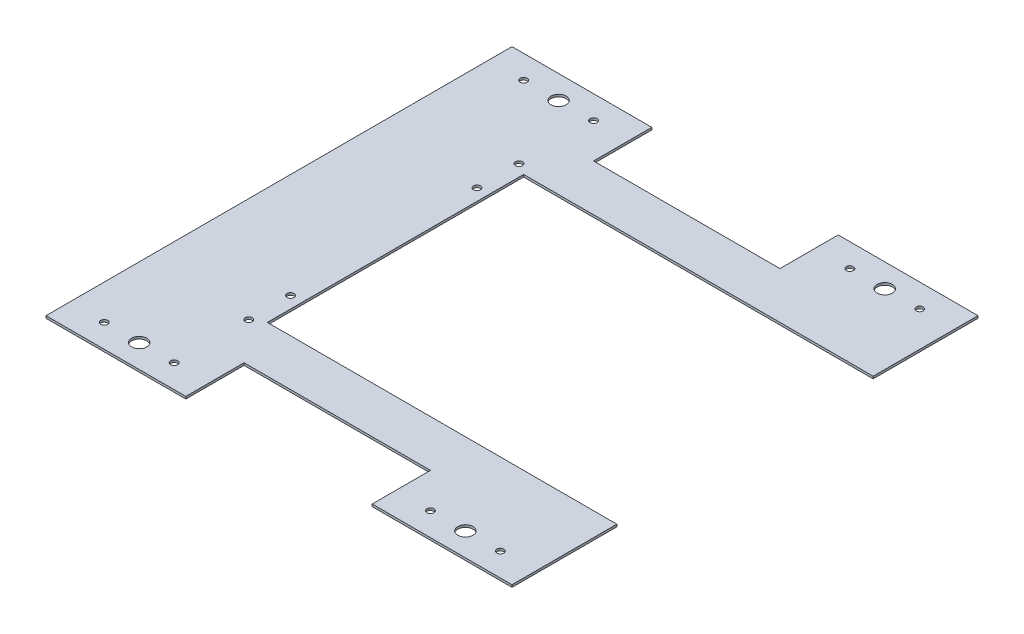
ISO-10303-21;
HEADER;
FILE_DESCRIPTION(('STEP AP214'),'2;1');
FILE_NAME('part.step','',(''),(''),'','','');
FILE_SCHEMA(('AUTOMOTIVE_DESIGN { 1 0 10303 214 1 1 1 1 }'));
ENDSEC;
DATA;
#1=APPLICATION_CONTEXT('core data for automotive mechanical design processes');
#2=APPLICATION_PROTOCOL_DEFINITION('international standard','automotive_design',2000,#1);
#3=PRODUCT_CONTEXT('',#1,'mechanical');
#4=PRODUCT('Part','Part','',(#3));
#5=PRODUCT_RELATED_PRODUCT_CATEGORY('part','',(#4));
#6=PRODUCT_DEFINITION_FORMATION('','',#4);
#7=PRODUCT_DEFINITION_CONTEXT('part definition',#1,'design');
#8=PRODUCT_DEFINITION('design','',#6,#7);
#9=PRODUCT_DEFINITION_SHAPE('','',#8);
#10=(LENGTH_UNIT() NAMED_UNIT(*) SI_UNIT(.MILLI.,.METRE.));
#11=(NAMED_UNIT(*) PLANE_ANGLE_UNIT() SI_UNIT($,.RADIAN.));
#12=(NAMED_UNIT(*) SI_UNIT($,.STERADIAN.) SOLID_ANGLE_UNIT());
#13=UNCERTAINTY_MEASURE_WITH_UNIT(LENGTH_MEASURE(1.E-05),#10,'distance_accuracy_value','');
#14=(GEOMETRIC_REPRESENTATION_CONTEXT(3) GLOBAL_UNCERTAINTY_ASSIGNED_CONTEXT((#13)) GLOBAL_UNIT_ASSIGNED_CONTEXT((#10,
#11,#12)) REPRESENTATION_CONTEXT('',''));
#15=CARTESIAN_POINT('',(0.,0.,0.));
#16=DIRECTION('',(0.,0.,1.));
#17=DIRECTION('',(1.,0.,0.));
#18=AXIS2_PLACEMENT_3D('',#15,#16,#17);
#19=CARTESIAN_POINT('',(100.,1.,-55.));
#20=DIRECTION('',(0.,-1.,0.));
#21=DIRECTION('',(0.,0.,-1.));
#22=AXIS2_PLACEMENT_3D('',#19,#20,#21);
#23=PLANE('',#22);
#24=CARTESIAN_POINT('',(55.,1.,-90.));
#25=DIRECTION('',(0.,1.,0.));
#26=DIRECTION('',(0.,0.,1.));
#27=AXIS2_PLACEMENT_3D('',#24,#25,#26);
#28=CIRCLE('',#27,1.5);
#29=CARTESIAN_POINT('',(55.,1.,-88.5));
#30=VERTEX_POINT('',#29);
#31=EDGE_CURVE('E390',#30,#30,#28,.T.);
#32=ORIENTED_EDGE('',*,*,#31,.F.);
#33=EDGE_LOOP('',(#32));
#34=FACE_BOUND('',#33,.T.);
#35=CARTESIAN_POINT('',(70.,1.,-90.));
#36=DIRECTION('',(0.,1.,0.));
#37=DIRECTION('',(0.,0.,1.));
#38=AXIS2_PLACEMENT_3D('',#35,#36,#37);
#39=CIRCLE('',#38,3.25000000000012);
#40=CARTESIAN_POINT('',(70.,1.,-86.7499999999999));
#41=VERTEX_POINT('',#40);
#42=EDGE_CURVE('E402',#41,#41,#39,.T.);
#43=ORIENTED_EDGE('',*,*,#42,.F.);
#44=EDGE_LOOP('',(#43));
#45=FACE_BOUND('',#44,.T.);
#46=CARTESIAN_POINT('',(-69.9999999999999,1.,90.0000000000001));
#47=DIRECTION('',(0.,1.,0.));
#48=DIRECTION('',(0.,0.,1.));
#49=AXIS2_PLACEMENT_3D('',#46,#47,#48);
#50=CIRCLE('',#49,3.25000000000001);
#51=CARTESIAN_POINT('',(-69.9999999999999,1.,93.2500000000001));
#52=VERTEX_POINT('',#51);
#53=EDGE_CURVE('E414',#52,#52,#50,.T.);
#54=ORIENTED_EDGE('',*,*,#53,.F.);
#55=EDGE_LOOP('',(#54));
#56=FACE_BOUND('',#55,.T.);
#57=CARTESIAN_POINT('',(-54.9999999999999,1.,-39.9999999999999));
#58=DIRECTION('',(0.,1.,0.));
#59=DIRECTION('',(0.,0.,1.));
#60=AXIS2_PLACEMENT_3D('',#57,#58,#59);
#61=CIRCLE('',#60,1.5);
#62=CARTESIAN_POINT('',(-54.9999999999999,1.,-38.4999999999999));
#63=VERTEX_POINT('',#62);
#64=EDGE_CURVE('E426',#63,#63,#61,.T.);
#65=ORIENTED_EDGE('',*,*,#64,.F.);
#66=EDGE_LOOP('',(#65));
#67=FACE_BOUND('',#66,.T.);
#68=CARTESIAN_POINT('',(-54.9999999999999,1.,58.0000000000001));
#69=DIRECTION('',(0.,1.,0.));
#70=DIRECTION('',(0.,0.,1.));
#71=AXIS2_PLACEMENT_3D('',#68,#69,#70);
#72=CIRCLE('',#71,1.5);
#73=CARTESIAN_POINT('',(-54.9999999999999,1.,59.5000000000001));
#74=VERTEX_POINT('',#73);
#75=EDGE_CURVE('E438',#74,#74,#72,.T.);
#76=ORIENTED_EDGE('',*,*,#75,.F.);
#77=EDGE_LOOP('',(#76));
#78=FACE_BOUND('',#77,.T.);
#79=CARTESIAN_POINT('',(55.,1.,90.));
#80=DIRECTION('',(0.,1.,0.));
#81=DIRECTION('',(0.,0.,-1.));
#82=AXIS2_PLACEMENT_3D('',#79,#80,#81);
#83=CIRCLE('',#82,1.5);
#84=CARTESIAN_POINT('',(55.,1.,88.5));
#85=VERTEX_POINT('',#84);
#86=EDGE_CURVE('E450',#85,#85,#83,.T.);
#87=ORIENTED_EDGE('',*,*,#86,.F.);
#88=EDGE_LOOP('',(#87));
#89=FACE_BOUND('',#88,.T.);
#90=CARTESIAN_POINT('',(-55.,1.,90.));
#91=DIRECTION('',(0.,1.,0.));
#92=DIRECTION('',(0.,0.,1.));
#93=AXIS2_PLACEMENT_3D('',#90,#91,#92);
#94=CIRCLE('',#93,1.5);
#95=CARTESIAN_POINT('',(-55.,1.,91.5));
#96=VERTEX_POINT('',#95);
#97=EDGE_CURVE('E462',#96,#96,#94,.T.);
#98=ORIENTED_EDGE('',*,*,#97,.F.);
#99=EDGE_LOOP('',(#98));
#100=FACE_BOUND('',#99,.T.);
#101=CARTESIAN_POINT('',(-85.,1.,-90.));
#102=DIRECTION('',(0.,1.,0.));
#103=DIRECTION('',(0.,0.,-1.));
#104=AXIS2_PLACEMENT_3D('',#101,#102,#103);
#105=CIRCLE('',#104,1.5);
#106=CARTESIAN_POINT('',(-85.,1.,-91.5));
#107=VERTEX_POINT('',#106);
#108=EDGE_CURVE('E180',#107,#107,#105,.T.);
#109=ORIENTED_EDGE('',*,*,#108,.F.);
#110=EDGE_LOOP('',(#109));
#111=FACE_BOUND('',#110,.T.);
#112=DIRECTION('',(0.,0.,-1.));
#113=VECTOR('',#112,1.);
#114=CARTESIAN_POINT('',(100.,1.,-100.));
#115=LINE('',#114,#113);
#116=CARTESIAN_POINT('',(100.,1.,-55.));
#117=VERTEX_POINT('',#116);
#118=CARTESIAN_POINT('',(100.,1.,-100.));
#119=VERTEX_POINT('',#118);
#120=EDGE_CURVE('E207',#117,#119,#115,.T.);
#121=ORIENTED_EDGE('',*,*,#120,.T.);
#122=DIRECTION('',(-1.,0.,0.));
#123=VECTOR('',#122,1.);
#124=CARTESIAN_POINT('',(40.,1.,-100.));
#125=LINE('',#124,#123);
#126=CARTESIAN_POINT('',(40.,1.,-100.));
#127=VERTEX_POINT('',#126);
#128=EDGE_CURVE('E115',#119,#127,#125,.T.);
#129=ORIENTED_EDGE('',*,*,#128,.T.);
#130=DIRECTION('',(0.,0.,1.));
#131=VECTOR('',#130,1.);
#132=CARTESIAN_POINT('',(40.,1.,-100.));
#133=LINE('',#132,#131);
#134=CARTESIAN_POINT('',(40.,1.,-75.));
#135=VERTEX_POINT('',#134);
#136=EDGE_CURVE('E246',#127,#135,#133,.T.);
#137=ORIENTED_EDGE('',*,*,#136,.T.);
#138=DIRECTION('',(-1.,0.,0.));
#139=VECTOR('',#138,1.);
#140=CARTESIAN_POINT('',(-40.,1.,-75.));
#141=LINE('',#140,#139);
#142=CARTESIAN_POINT('',(-40.,1.,-75.));
#143=VERTEX_POINT('',#142);
#144=EDGE_CURVE('E265',#135,#143,#141,.T.);
#145=ORIENTED_EDGE('',*,*,#144,.T.);
#146=DIRECTION('',(0.,0.,-1.));
#147=VECTOR('',#146,1.);
#148=CARTESIAN_POINT('',(-40.,1.,-100.));
#149=LINE('',#148,#147);
#150=CARTESIAN_POINT('',(-40.,1.,-100.));
#151=VERTEX_POINT('',#150);
#152=EDGE_CURVE('E262',#143,#151,#149,.T.);
#153=ORIENTED_EDGE('',*,*,#152,.T.);
#154=DIRECTION('',(-1.,0.,0.));
#155=VECTOR('',#154,1.);
#156=CARTESIAN_POINT('',(-99.9999999999999,1.,-100.));
#157=LINE('',#156,#155);
#158=CARTESIAN_POINT('',(-99.9999999999999,1.,-100.));
#159=VERTEX_POINT('',#158);
#160=EDGE_CURVE('E264',#151,#159,#157,.T.);
#161=ORIENTED_EDGE('',*,*,#160,.T.);
#162=DIRECTION('',(0.,0.,1.));
#163=VECTOR('',#162,1.);
#164=CARTESIAN_POINT('',(-99.9999999999999,1.,100.));
#165=LINE('',#164,#163);
#166=CARTESIAN_POINT('',(-99.9999999999999,1.,100.));
#167=VERTEX_POINT('',#166);
#168=EDGE_CURVE('E267',#159,#167,#165,.T.);
#169=ORIENTED_EDGE('',*,*,#168,.T.);
#170=DIRECTION('',(1.,0.,0.));
#171=VECTOR('',#170,1.);
#172=CARTESIAN_POINT('',(-99.9999999999999,1.,100.));
#173=LINE('',#172,#171);
#174=CARTESIAN_POINT('',(-40.,1.,100.));
#175=VERTEX_POINT('',#174);
#176=EDGE_CURVE('E273',#167,#175,#173,.T.);
#177=ORIENTED_EDGE('',*,*,#176,.T.);
#178=DIRECTION('',(0.,0.,-1.));
#179=VECTOR('',#178,1.);
#180=CARTESIAN_POINT('',(-40.,1.,100.));
#181=LINE('',#180,#179);
#182=CARTESIAN_POINT('',(-40.,1.,75.));
#183=VERTEX_POINT('',#182);
#184=EDGE_CURVE('E275',#175,#183,#181,.T.);
#185=ORIENTED_EDGE('',*,*,#184,.T.);
#186=DIRECTION('',(1.,0.,0.));
#187=VECTOR('',#186,1.);
#188=CARTESIAN_POINT('',(-40.,1.,75.));
#189=LINE('',#188,#187);
#190=CARTESIAN_POINT('',(40.,1.,75.));
#191=VERTEX_POINT('',#190);
#192=EDGE_CURVE('E277',#183,#191,#189,.T.);
#193=ORIENTED_EDGE('',*,*,#192,.T.);
#194=DIRECTION('',(0.,0.,1.));
#195=VECTOR('',#194,1.);
#196=CARTESIAN_POINT('',(40.,1.,100.));
#197=LINE('',#196,#195);
#198=CARTESIAN_POINT('',(40.,1.,100.));
#199=VERTEX_POINT('',#198);
#200=EDGE_CURVE('E279',#191,#199,#197,.T.);
#201=ORIENTED_EDGE('',*,*,#200,.T.);
#202=DIRECTION('',(1.,0.,0.));
#203=VECTOR('',#202,1.);
#204=CARTESIAN_POINT('',(40.,1.,100.));
#205=LINE('',#204,#203);
#206=CARTESIAN_POINT('',(100.,1.,100.));
#207=VERTEX_POINT('',#206);
#208=EDGE_CURVE('E281',#199,#207,#205,.T.);
#209=ORIENTED_EDGE('',*,*,#208,.T.);
#210=DIRECTION('',(0.,0.,-1.));
#211=VECTOR('',#210,1.);
#212=CARTESIAN_POINT('',(100.,1.,100.));
#213=LINE('',#212,#211);
#214=CARTESIAN_POINT('',(100.,1.,55.));
#215=VERTEX_POINT('',#214);
#216=EDGE_CURVE('E158',#207,#215,#213,.T.);
#217=ORIENTED_EDGE('',*,*,#216,.T.);
#218=DIRECTION('',(-1.,0.,0.));
#219=VECTOR('',#218,1.);
#220=CARTESIAN_POINT('',(100.,1.,55.));
#221=LINE('',#220,#219);
#222=CARTESIAN_POINT('',(-49.9999999999999,1.,55.));
#223=VERTEX_POINT('',#222);
#224=EDGE_CURVE('E152',#215,#223,#221,.T.);
#225=ORIENTED_EDGE('',*,*,#224,.T.);
#226=DIRECTION('',(0.,0.,-1.));
#227=VECTOR('',#226,1.);
#228=CARTESIAN_POINT('',(-50.,1.,-55.));
#229=LINE('',#228,#227);
#230=CARTESIAN_POINT('',(-50.,1.,-55.));
#231=VERTEX_POINT('',#230);
#232=EDGE_CURVE('E156',#223,#231,#229,.T.);
#233=ORIENTED_EDGE('',*,*,#232,.T.);
#234=DIRECTION('',(1.,0.,0.));
#235=VECTOR('',#234,1.);
#236=CARTESIAN_POINT('',(100.,1.,-55.));
#237=LINE('',#236,#235);
#238=EDGE_CURVE('E48',#231,#117,#237,.T.);
#239=ORIENTED_EDGE('',*,*,#238,.T.);
#240=EDGE_LOOP('',(#121,#129,#137,#145,#153,#161,#169,#177,#185,#193,#201,#209,#217,#225,#233,#239));
#241=FACE_BOUND('',#240,.T.);
#242=CARTESIAN_POINT('',(-55.,1.,-90.));
#243=DIRECTION('',(0.,1.,0.));
#244=DIRECTION('',(0.,0.,-1.));
#245=AXIS2_PLACEMENT_3D('',#242,#243,#244);
#246=CIRCLE('',#245,1.5);
#247=CARTESIAN_POINT('',(-55.,1.,-91.5));
#248=VERTEX_POINT('',#247);
#249=EDGE_CURVE('E468',#248,#248,#246,.T.);
#250=ORIENTED_EDGE('',*,*,#249,.F.);
#251=EDGE_LOOP('',(#250));
#252=FACE_BOUND('',#251,.T.);
#253=CARTESIAN_POINT('',(-85.,1.,90.));
#254=DIRECTION('',(0.,1.,0.));
#255=DIRECTION('',(0.,0.,1.));
#256=AXIS2_PLACEMENT_3D('',#253,#254,#255);
#257=CIRCLE('',#256,1.5);
#258=CARTESIAN_POINT('',(-85.,1.,91.5));
#259=VERTEX_POINT('',#258);
#260=EDGE_CURVE('E456',#259,#259,#257,.T.);
#261=ORIENTED_EDGE('',*,*,#260,.F.);
#262=EDGE_LOOP('',(#261));
#263=FACE_BOUND('',#262,.T.);
#264=CARTESIAN_POINT('',(85.,1.,90.));
#265=DIRECTION('',(0.,1.,0.));
#266=DIRECTION('',(0.,0.,-1.));
#267=AXIS2_PLACEMENT_3D('',#264,#265,#266);
#268=CIRCLE('',#267,1.5);
#269=CARTESIAN_POINT('',(85.,1.,88.5));
#270=VERTEX_POINT('',#269);
#271=EDGE_CURVE('E444',#270,#270,#268,.T.);
#272=ORIENTED_EDGE('',*,*,#271,.F.);
#273=EDGE_LOOP('',(#272));
#274=FACE_BOUND('',#273,.T.);
#275=CARTESIAN_POINT('',(-54.9999999999999,1.,40.0000000000001));
#276=DIRECTION('',(0.,1.,0.));
#277=DIRECTION('',(0.,0.,1.));
#278=AXIS2_PLACEMENT_3D('',#275,#276,#277);
#279=CIRCLE('',#278,1.5);
#280=CARTESIAN_POINT('',(-54.9999999999999,1.,41.5000000000001));
#281=VERTEX_POINT('',#280);
#282=EDGE_CURVE('E432',#281,#281,#279,.T.);
#283=ORIENTED_EDGE('',*,*,#282,.F.);
#284=EDGE_LOOP('',(#283));
#285=FACE_BOUND('',#284,.T.);
#286=CARTESIAN_POINT('',(-54.9999999999999,1.,-57.9999999999999));
#287=DIRECTION('',(0.,1.,0.));
#288=DIRECTION('',(0.,0.,1.));
#289=AXIS2_PLACEMENT_3D('',#286,#287,#288);
#290=CIRCLE('',#289,1.5);
#291=CARTESIAN_POINT('',(-54.9999999999999,1.,-56.4999999999999));
#292=VERTEX_POINT('',#291);
#293=EDGE_CURVE('E420',#292,#292,#290,.T.);
#294=ORIENTED_EDGE('',*,*,#293,.F.);
#295=EDGE_LOOP('',(#294));
#296=FACE_BOUND('',#295,.T.);
#297=CARTESIAN_POINT('',(70.,1.,90.0000000000001));
#298=DIRECTION('',(0.,1.,0.));
#299=DIRECTION('',(0.,0.,1.));
#300=AXIS2_PLACEMENT_3D('',#297,#298,#299);
#301=CIRCLE('',#300,3.25000000000012);
#302=CARTESIAN_POINT('',(70.,1.,93.2500000000002));
#303=VERTEX_POINT('',#302);
#304=EDGE_CURVE('E408',#303,#303,#301,.T.);
#305=ORIENTED_EDGE('',*,*,#304,.F.);
#306=EDGE_LOOP('',(#305));
#307=FACE_BOUND('',#306,.T.);
#308=CARTESIAN_POINT('',(-69.9999999999999,1.,-89.9999999999999));
#309=DIRECTION('',(0.,1.,0.));
#310=DIRECTION('',(0.,0.,1.));
#311=AXIS2_PLACEMENT_3D('',#308,#309,#310);
#312=CIRCLE('',#311,3.25000000000001);
#313=CARTESIAN_POINT('',(-69.9999999999999,1.,-86.7499999999999));
#314=VERTEX_POINT('',#313);
#315=EDGE_CURVE('E396',#314,#314,#312,.T.);
#316=ORIENTED_EDGE('',*,*,#315,.F.);
#317=EDGE_LOOP('',(#316));
#318=FACE_BOUND('',#317,.T.);
#319=CARTESIAN_POINT('',(85.,1.,-90.));
#320=DIRECTION('',(0.,1.,0.));
#321=DIRECTION('',(0.,0.,1.));
#322=AXIS2_PLACEMENT_3D('',#319,#320,#321);
#323=CIRCLE('',#322,1.5);
#324=CARTESIAN_POINT('',(85.,1.,-88.5));
#325=VERTEX_POINT('',#324);
#326=EDGE_CURVE('E381',#325,#325,#323,.T.);
#327=ORIENTED_EDGE('',*,*,#326,.F.);
#328=EDGE_LOOP('',(#327));
#329=FACE_BOUND('',#328,.T.);
#330=ADVANCED_FACE('F31',(#34,#45,#56,#67,#78,#89,#100,#111,#241,#252,#263,#274,#285,#296,#307,
#318,#329),#23,.F.);
#331=CARTESIAN_POINT('',(100.,0.,-55.));
#332=DIRECTION('',(0.,-1.,0.));
#333=DIRECTION('',(0.,0.,-1.));
#334=AXIS2_PLACEMENT_3D('',#331,#332,#333);
#335=PLANE('',#334);
#336=CARTESIAN_POINT('',(55.,0.,-90.));
#337=DIRECTION('',(0.,1.,0.));
#338=DIRECTION('',(0.,0.,1.));
#339=AXIS2_PLACEMENT_3D('',#336,#337,#338);
#340=CIRCLE('',#339,1.5);
#341=CARTESIAN_POINT('',(55.,0.,-88.5));
#342=VERTEX_POINT('',#341);
#343=EDGE_CURVE('E387',#342,#342,#340,.T.);
#344=ORIENTED_EDGE('',*,*,#343,.T.);
#345=EDGE_LOOP('',(#344));
#346=FACE_BOUND('',#345,.T.);
#347=CARTESIAN_POINT('',(70.,0.,-90.));
#348=DIRECTION('',(0.,1.,0.));
#349=DIRECTION('',(0.,0.,1.));
#350=AXIS2_PLACEMENT_3D('',#347,#348,#349);
#351=CIRCLE('',#350,3.25000000000012);
#352=CARTESIAN_POINT('',(70.,0.,-86.7499999999999));
#353=VERTEX_POINT('',#352);
#354=EDGE_CURVE('E399',#353,#353,#351,.T.);
#355=ORIENTED_EDGE('',*,*,#354,.T.);
#356=EDGE_LOOP('',(#355));
#357=FACE_BOUND('',#356,.T.);
#358=CARTESIAN_POINT('',(-69.9999999999999,0.,90.0000000000001));
#359=DIRECTION('',(0.,1.,0.));
#360=DIRECTION('',(0.,0.,1.));
#361=AXIS2_PLACEMENT_3D('',#358,#359,#360);
#362=CIRCLE('',#361,3.25000000000001);
#363=CARTESIAN_POINT('',(-69.9999999999999,0.,93.2500000000001));
#364=VERTEX_POINT('',#363);
#365=EDGE_CURVE('E411',#364,#364,#362,.T.);
#366=ORIENTED_EDGE('',*,*,#365,.T.);
#367=EDGE_LOOP('',(#366));
#368=FACE_BOUND('',#367,.T.);
#369=CARTESIAN_POINT('',(-54.9999999999999,0.,-39.9999999999999));
#370=DIRECTION('',(0.,1.,0.));
#371=DIRECTION('',(0.,0.,1.));
#372=AXIS2_PLACEMENT_3D('',#369,#370,#371);
#373=CIRCLE('',#372,1.5);
#374=CARTESIAN_POINT('',(-54.9999999999999,0.,-38.4999999999999));
#375=VERTEX_POINT('',#374);
#376=EDGE_CURVE('E423',#375,#375,#373,.T.);
#377=ORIENTED_EDGE('',*,*,#376,.T.);
#378=EDGE_LOOP('',(#377));
#379=FACE_BOUND('',#378,.T.);
#380=CARTESIAN_POINT('',(-54.9999999999999,0.,58.0000000000001));
#381=DIRECTION('',(0.,1.,0.));
#382=DIRECTION('',(0.,0.,1.));
#383=AXIS2_PLACEMENT_3D('',#380,#381,#382);
#384=CIRCLE('',#383,1.5);
#385=CARTESIAN_POINT('',(-54.9999999999999,0.,59.5000000000001));
#386=VERTEX_POINT('',#385);
#387=EDGE_CURVE('E435',#386,#386,#384,.T.);
#388=ORIENTED_EDGE('',*,*,#387,.T.);
#389=EDGE_LOOP('',(#388));
#390=FACE_BOUND('',#389,.T.);
#391=CARTESIAN_POINT('',(55.,0.,90.));
#392=DIRECTION('',(0.,1.,0.));
#393=DIRECTION('',(0.,0.,-1.));
#394=AXIS2_PLACEMENT_3D('',#391,#392,#393);
#395=CIRCLE('',#394,1.5);
#396=CARTESIAN_POINT('',(55.,0.,88.5));
#397=VERTEX_POINT('',#396);
#398=EDGE_CURVE('E447',#397,#397,#395,.T.);
#399=ORIENTED_EDGE('',*,*,#398,.T.);
#400=EDGE_LOOP('',(#399));
#401=FACE_BOUND('',#400,.T.);
#402=CARTESIAN_POINT('',(-55.,0.,90.));
#403=DIRECTION('',(0.,1.,0.));
#404=DIRECTION('',(0.,0.,1.));
#405=AXIS2_PLACEMENT_3D('',#402,#403,#404);
#406=CIRCLE('',#405,1.5);
#407=CARTESIAN_POINT('',(-55.,0.,91.5));
#408=VERTEX_POINT('',#407);
#409=EDGE_CURVE('E459',#408,#408,#406,.T.);
#410=ORIENTED_EDGE('',*,*,#409,.T.);
#411=EDGE_LOOP('',(#410));
#412=FACE_BOUND('',#411,.T.);
#413=CARTESIAN_POINT('',(-85.,0.,-90.));
#414=DIRECTION('',(0.,1.,0.));
#415=DIRECTION('',(0.,0.,-1.));
#416=AXIS2_PLACEMENT_3D('',#413,#414,#415);
#417=CIRCLE('',#416,1.5);
#418=CARTESIAN_POINT('',(-85.,0.,-91.5));
#419=VERTEX_POINT('',#418);
#420=EDGE_CURVE('E471',#419,#419,#417,.T.);
#421=ORIENTED_EDGE('',*,*,#420,.T.);
#422=EDGE_LOOP('',(#421));
#423=FACE_BOUND('',#422,.T.);
#424=DIRECTION('',(0.,0.,-1.));
#425=VECTOR('',#424,1.);
#426=CARTESIAN_POINT('',(100.,0.,-100.));
#427=LINE('',#426,#425);
#428=CARTESIAN_POINT('',(100.,0.,-55.));
#429=VERTEX_POINT('',#428);
#430=CARTESIAN_POINT('',(100.,0.,-100.));
#431=VERTEX_POINT('',#430);
#432=EDGE_CURVE('E176',#429,#431,#427,.T.);
#433=ORIENTED_EDGE('',*,*,#432,.F.);
#434=DIRECTION('',(1.,0.,0.));
#435=VECTOR('',#434,1.);
#436=CARTESIAN_POINT('',(100.,0.,-55.));
#437=LINE('',#436,#435);
#438=CARTESIAN_POINT('',(-50.,0.,-55.));
#439=VERTEX_POINT('',#438);
#440=EDGE_CURVE('E107',#439,#429,#437,.T.);
#441=ORIENTED_EDGE('',*,*,#440,.F.);
#442=DIRECTION('',(0.,0.,-1.));
#443=VECTOR('',#442,1.);
#444=CARTESIAN_POINT('',(-50.,0.,-55.));
#445=LINE('',#444,#443);
#446=CARTESIAN_POINT('',(-49.9999999999999,0.,55.));
#447=VERTEX_POINT('',#446);
#448=EDGE_CURVE('E101',#447,#439,#445,.T.);
#449=ORIENTED_EDGE('',*,*,#448,.F.);
#450=DIRECTION('',(-1.,0.,0.));
#451=VECTOR('',#450,1.);
#452=CARTESIAN_POINT('',(100.,0.,55.));
#453=LINE('',#452,#451);
#454=CARTESIAN_POINT('',(100.,0.,55.));
#455=VERTEX_POINT('',#454);
#456=EDGE_CURVE('E166',#455,#447,#453,.T.);
#457=ORIENTED_EDGE('',*,*,#456,.F.);
#458=DIRECTION('',(0.,0.,-1.));
#459=VECTOR('',#458,1.);
#460=CARTESIAN_POINT('',(100.,0.,100.));
#461=LINE('',#460,#459);
#462=CARTESIAN_POINT('',(100.,0.,100.));
#463=VERTEX_POINT('',#462);
#464=EDGE_CURVE('E202',#463,#455,#461,.T.);
#465=ORIENTED_EDGE('',*,*,#464,.F.);
#466=DIRECTION('',(1.,0.,0.));
#467=VECTOR('',#466,1.);
#468=CARTESIAN_POINT('',(40.,0.,100.));
#469=LINE('',#468,#467);
#470=CARTESIAN_POINT('',(40.,0.,100.));
#471=VERTEX_POINT('',#470);
#472=EDGE_CURVE('E200',#471,#463,#469,.T.);
#473=ORIENTED_EDGE('',*,*,#472,.F.);
#474=DIRECTION('',(0.,0.,1.));
#475=VECTOR('',#474,1.);
#476=CARTESIAN_POINT('',(40.,0.,100.));
#477=LINE('',#476,#475);
#478=CARTESIAN_POINT('',(40.,0.,75.));
#479=VERTEX_POINT('',#478);
#480=EDGE_CURVE('E198',#479,#471,#477,.T.);
#481=ORIENTED_EDGE('',*,*,#480,.F.);
#482=DIRECTION('',(1.,0.,0.));
#483=VECTOR('',#482,1.);
#484=CARTESIAN_POINT('',(-40.,0.,75.));
#485=LINE('',#484,#483);
#486=CARTESIAN_POINT('',(-40.,0.,75.));
#487=VERTEX_POINT('',#486);
#488=EDGE_CURVE('E196',#487,#479,#485,.T.);
#489=ORIENTED_EDGE('',*,*,#488,.F.);
#490=DIRECTION('',(0.,0.,-1.));
#491=VECTOR('',#490,1.);
#492=CARTESIAN_POINT('',(-40.,0.,100.));
#493=LINE('',#492,#491);
#494=CARTESIAN_POINT('',(-40.,0.,100.));
#495=VERTEX_POINT('',#494);
#496=EDGE_CURVE('E194',#495,#487,#493,.T.);
#497=ORIENTED_EDGE('',*,*,#496,.F.);
#498=DIRECTION('',(1.,0.,0.));
#499=VECTOR('',#498,1.);
#500=CARTESIAN_POINT('',(-99.9999999999999,0.,100.));
#501=LINE('',#500,#499);
#502=CARTESIAN_POINT('',(-99.9999999999999,0.,100.));
#503=VERTEX_POINT('',#502);
#504=EDGE_CURVE('E192',#503,#495,#501,.T.);
#505=ORIENTED_EDGE('',*,*,#504,.F.);
#506=DIRECTION('',(0.,0.,1.));
#507=VECTOR('',#506,1.);
#508=CARTESIAN_POINT('',(-99.9999999999999,0.,100.));
#509=LINE('',#508,#507);
#510=CARTESIAN_POINT('',(-99.9999999999999,0.,-100.));
#511=VERTEX_POINT('',#510);
#512=EDGE_CURVE('E190',#511,#503,#509,.T.);
#513=ORIENTED_EDGE('',*,*,#512,.F.);
#514=DIRECTION('',(-1.,0.,0.));
#515=VECTOR('',#514,1.);
#516=CARTESIAN_POINT('',(-99.9999999999999,0.,-100.));
#517=LINE('',#516,#515);
#518=CARTESIAN_POINT('',(-40.,0.,-100.));
#519=VERTEX_POINT('',#518);
#520=EDGE_CURVE('E188',#519,#511,#517,.T.);
#521=ORIENTED_EDGE('',*,*,#520,.F.);
#522=DIRECTION('',(0.,0.,-1.));
#523=VECTOR('',#522,1.);
#524=CARTESIAN_POINT('',(-40.,0.,-100.));
#525=LINE('',#524,#523);
#526=CARTESIAN_POINT('',(-40.,0.,-75.));
#527=VERTEX_POINT('',#526);
#528=EDGE_CURVE('E186',#527,#519,#525,.T.);
#529=ORIENTED_EDGE('',*,*,#528,.F.);
#530=DIRECTION('',(-1.,0.,0.));
#531=VECTOR('',#530,1.);
#532=CARTESIAN_POINT('',(-40.,0.,-75.));
#533=LINE('',#532,#531);
#534=CARTESIAN_POINT('',(40.,0.,-75.));
#535=VERTEX_POINT('',#534);
#536=EDGE_CURVE('E184',#535,#527,#533,.T.);
#537=ORIENTED_EDGE('',*,*,#536,.F.);
#538=DIRECTION('',(0.,0.,1.));
#539=VECTOR('',#538,1.);
#540=CARTESIAN_POINT('',(40.,0.,-100.));
#541=LINE('',#540,#539);
#542=CARTESIAN_POINT('',(40.,0.,-100.));
#543=VERTEX_POINT('',#542);
#544=EDGE_CURVE('E182',#543,#535,#541,.T.);
#545=ORIENTED_EDGE('',*,*,#544,.F.);
#546=DIRECTION('',(-1.,0.,0.));
#547=VECTOR('',#546,1.);
#548=CARTESIAN_POINT('',(40.,0.,-100.));
#549=LINE('',#548,#547);
#550=EDGE_CURVE('E179',#431,#543,#549,.T.);
#551=ORIENTED_EDGE('',*,*,#550,.F.);
#552=EDGE_LOOP('',(#433,#441,#449,#457,#465,#473,#481,#489,#497,#505,#513,#521,#529,#537,#545,#551));
#553=FACE_BOUND('',#552,.T.);
#554=CARTESIAN_POINT('',(-55.,0.,-90.));
#555=DIRECTION('',(0.,1.,0.));
#556=DIRECTION('',(0.,0.,-1.));
#557=AXIS2_PLACEMENT_3D('',#554,#555,#556);
#558=CIRCLE('',#557,1.5);
#559=CARTESIAN_POINT('',(-55.,0.,-91.5));
#560=VERTEX_POINT('',#559);
#561=EDGE_CURVE('E465',#560,#560,#558,.T.);
#562=ORIENTED_EDGE('',*,*,#561,.T.);
#563=EDGE_LOOP('',(#562));
#564=FACE_BOUND('',#563,.T.);
#565=CARTESIAN_POINT('',(-85.,0.,90.));
#566=DIRECTION('',(0.,1.,0.));
#567=DIRECTION('',(0.,0.,1.));
#568=AXIS2_PLACEMENT_3D('',#565,#566,#567);
#569=CIRCLE('',#568,1.5);
#570=CARTESIAN_POINT('',(-85.,0.,91.5));
#571=VERTEX_POINT('',#570);
#572=EDGE_CURVE('E453',#571,#571,#569,.T.);
#573=ORIENTED_EDGE('',*,*,#572,.T.);
#574=EDGE_LOOP('',(#573));
#575=FACE_BOUND('',#574,.T.);
#576=CARTESIAN_POINT('',(85.,0.,90.));
#577=DIRECTION('',(0.,1.,0.));
#578=DIRECTION('',(0.,0.,-1.));
#579=AXIS2_PLACEMENT_3D('',#576,#577,#578);
#580=CIRCLE('',#579,1.5);
#581=CARTESIAN_POINT('',(85.,0.,88.5));
#582=VERTEX_POINT('',#581);
#583=EDGE_CURVE('E441',#582,#582,#580,.T.);
#584=ORIENTED_EDGE('',*,*,#583,.T.);
#585=EDGE_LOOP('',(#584));
#586=FACE_BOUND('',#585,.T.);
#587=CARTESIAN_POINT('',(-54.9999999999999,0.,40.0000000000001));
#588=DIRECTION('',(0.,1.,0.));
#589=DIRECTION('',(0.,0.,1.));
#590=AXIS2_PLACEMENT_3D('',#587,#588,#589);
#591=CIRCLE('',#590,1.5);
#592=CARTESIAN_POINT('',(-54.9999999999999,0.,41.5000000000001));
#593=VERTEX_POINT('',#592);
#594=EDGE_CURVE('E429',#593,#593,#591,.T.);
#595=ORIENTED_EDGE('',*,*,#594,.T.);
#596=EDGE_LOOP('',(#595));
#597=FACE_BOUND('',#596,.T.);
#598=CARTESIAN_POINT('',(-54.9999999999999,0.,-57.9999999999999));
#599=DIRECTION('',(0.,1.,0.));
#600=DIRECTION('',(0.,0.,1.));
#601=AXIS2_PLACEMENT_3D('',#598,#599,#600);
#602=CIRCLE('',#601,1.5);
#603=CARTESIAN_POINT('',(-54.9999999999999,0.,-56.4999999999999));
#604=VERTEX_POINT('',#603);
#605=EDGE_CURVE('E417',#604,#604,#602,.T.);
#606=ORIENTED_EDGE('',*,*,#605,.T.);
#607=EDGE_LOOP('',(#606));
#608=FACE_BOUND('',#607,.T.);
#609=CARTESIAN_POINT('',(70.,0.,90.0000000000001));
#610=DIRECTION('',(0.,1.,0.));
#611=DIRECTION('',(0.,0.,1.));
#612=AXIS2_PLACEMENT_3D('',#609,#610,#611);
#613=CIRCLE('',#612,3.25000000000012);
#614=CARTESIAN_POINT('',(70.,0.,93.2500000000002));
#615=VERTEX_POINT('',#614);
#616=EDGE_CURVE('E405',#615,#615,#613,.T.);
#617=ORIENTED_EDGE('',*,*,#616,.T.);
#618=EDGE_LOOP('',(#617));
#619=FACE_BOUND('',#618,.T.);
#620=CARTESIAN_POINT('',(-69.9999999999999,0.,-89.9999999999999));
#621=DIRECTION('',(0.,1.,0.));
#622=DIRECTION('',(0.,0.,1.));
#623=AXIS2_PLACEMENT_3D('',#620,#621,#622);
#624=CIRCLE('',#623,3.25000000000001);
#625=CARTESIAN_POINT('',(-69.9999999999999,0.,-86.7499999999999));
#626=VERTEX_POINT('',#625);
#627=EDGE_CURVE('E393',#626,#626,#624,.T.);
#628=ORIENTED_EDGE('',*,*,#627,.T.);
#629=EDGE_LOOP('',(#628));
#630=FACE_BOUND('',#629,.T.);
#631=CARTESIAN_POINT('',(85.,0.,-90.));
#632=DIRECTION('',(0.,1.,0.));
#633=DIRECTION('',(0.,0.,1.));
#634=AXIS2_PLACEMENT_3D('',#631,#632,#633);
#635=CIRCLE('',#634,1.5);
#636=CARTESIAN_POINT('',(85.,0.,-88.5));
#637=VERTEX_POINT('',#636);
#638=EDGE_CURVE('E384',#637,#637,#635,.T.);
#639=ORIENTED_EDGE('',*,*,#638,.T.);
#640=EDGE_LOOP('',(#639));
#641=FACE_BOUND('',#640,.T.);
#642=ADVANCED_FACE('F250',(#346,#357,#368,#379,#390,#401,#412,#423,#553,#564,#575,#586,#597,
#608,#619,#630,#641),#335,.T.);
#643=CARTESIAN_POINT('',(100.,1.,-100.));
#644=DIRECTION('',(-1.,0.,0.));
#645=DIRECTION('',(0.,0.,1.));
#646=AXIS2_PLACEMENT_3D('',#643,#644,#645);
#647=PLANE('',#646);
#648=ORIENTED_EDGE('',*,*,#432,.T.);
#649=DIRECTION('',(0.,-1.,0.));
#650=VECTOR('',#649,1.);
#651=CARTESIAN_POINT('',(100.,1.,-100.));
#652=LINE('',#651,#650);
#653=EDGE_CURVE('E11',#119,#431,#652,.T.);
#654=ORIENTED_EDGE('',*,*,#653,.F.);
#655=ORIENTED_EDGE('',*,*,#120,.F.);
#656=DIRECTION('',(0.,-1.,0.));
#657=VECTOR('',#656,1.);
#658=CARTESIAN_POINT('',(100.,1.,-55.));
#659=LINE('',#658,#657);
#660=EDGE_CURVE('E172',#117,#429,#659,.T.);
#661=ORIENTED_EDGE('',*,*,#660,.T.);
#662=EDGE_LOOP('',(#648,#654,#655,#661));
#663=FACE_BOUND('',#662,.T.);
#664=ADVANCED_FACE('F33',(#663),#647,.F.);
#665=CARTESIAN_POINT('',(40.,1.,-100.));
#666=DIRECTION('',(0.,0.,1.));
#667=DIRECTION('',(1.,0.,0.));
#668=AXIS2_PLACEMENT_3D('',#665,#666,#667);
#669=PLANE('',#668);
#670=ORIENTED_EDGE('',*,*,#550,.T.);
#671=DIRECTION('',(0.,-1.,0.));
#672=VECTOR('',#671,1.);
#673=CARTESIAN_POINT('',(40.,1.,-100.));
#674=LINE('',#673,#672);
#675=EDGE_CURVE('E40',#127,#543,#674,.T.);
#676=ORIENTED_EDGE('',*,*,#675,.F.);
#677=ORIENTED_EDGE('',*,*,#128,.F.);
#678=ORIENTED_EDGE('',*,*,#653,.T.);
#679=EDGE_LOOP('',(#670,#676,#677,#678));
#680=FACE_BOUND('',#679,.T.);
#681=ADVANCED_FACE('F728',(#680),#669,.F.);
#682=CARTESIAN_POINT('',(40.,1.,-100.));
#683=DIRECTION('',(1.,0.,0.));
#684=DIRECTION('',(0.,0.,-1.));
#685=AXIS2_PLACEMENT_3D('',#682,#683,#684);
#686=PLANE('',#685);
#687=ORIENTED_EDGE('',*,*,#544,.T.);
#688=DIRECTION('',(0.,-1.,0.));
#689=VECTOR('',#688,1.);
#690=CARTESIAN_POINT('',(40.,1.,-75.));
#691=LINE('',#690,#689);
#692=EDGE_CURVE('E238',#135,#535,#691,.T.);
#693=ORIENTED_EDGE('',*,*,#692,.F.);
#694=ORIENTED_EDGE('',*,*,#136,.F.);
#695=ORIENTED_EDGE('',*,*,#675,.T.);
#696=EDGE_LOOP('',(#687,#693,#694,#695));
#697=FACE_BOUND('',#696,.T.);
#698=ADVANCED_FACE('F244',(#697),#686,.F.);
#699=CARTESIAN_POINT('',(-40.,1.,-75.));
#700=DIRECTION('',(0.,0.,1.));
#701=DIRECTION('',(1.,0.,0.));
#702=AXIS2_PLACEMENT_3D('',#699,#700,#701);
#703=PLANE('',#702);
#704=ORIENTED_EDGE('',*,*,#536,.T.);
#705=DIRECTION('',(0.,-1.,0.));
#706=VECTOR('',#705,1.);
#707=CARTESIAN_POINT('',(-40.,1.,-75.));
#708=LINE('',#707,#706);
#709=EDGE_CURVE('E235',#143,#527,#708,.T.);
#710=ORIENTED_EDGE('',*,*,#709,.F.);
#711=ORIENTED_EDGE('',*,*,#144,.F.);
#712=ORIENTED_EDGE('',*,*,#692,.T.);
#713=EDGE_LOOP('',(#704,#710,#711,#712));
#714=FACE_BOUND('',#713,.T.);
#715=ADVANCED_FACE('F256',(#714),#703,.F.);
#716=CARTESIAN_POINT('',(-40.,1.,-100.));
#717=DIRECTION('',(-1.,0.,0.));
#718=DIRECTION('',(0.,0.,1.));
#719=AXIS2_PLACEMENT_3D('',#716,#717,#718);
#720=PLANE('',#719);
#721=ORIENTED_EDGE('',*,*,#528,.T.);
#722=DIRECTION('',(0.,-1.,0.));
#723=VECTOR('',#722,1.);
#724=CARTESIAN_POINT('',(-40.,1.,-100.));
#725=LINE('',#724,#723);
#726=EDGE_CURVE('E232',#151,#519,#725,.T.);
#727=ORIENTED_EDGE('',*,*,#726,.F.);
#728=ORIENTED_EDGE('',*,*,#152,.F.);
#729=ORIENTED_EDGE('',*,*,#709,.T.);
#730=EDGE_LOOP('',(#721,#727,#728,#729));
#731=FACE_BOUND('',#730,.T.);
#732=ADVANCED_FACE('F260',(#731),#720,.F.);
#733=CARTESIAN_POINT('',(-99.9999999999999,1.,-100.));
#734=DIRECTION('',(0.,0.,1.));
#735=DIRECTION('',(1.,0.,0.));
#736=AXIS2_PLACEMENT_3D('',#733,#734,#735);
#737=PLANE('',#736);
#738=ORIENTED_EDGE('',*,*,#520,.T.);
#739=DIRECTION('',(0.,-1.,0.));
#740=VECTOR('',#739,1.);
#741=CARTESIAN_POINT('',(-99.9999999999999,1.,-100.));
#742=LINE('',#741,#740);
#743=EDGE_CURVE('E229',#159,#511,#742,.T.);
#744=ORIENTED_EDGE('',*,*,#743,.F.);
#745=ORIENTED_EDGE('',*,*,#160,.F.);
#746=ORIENTED_EDGE('',*,*,#726,.T.);
#747=EDGE_LOOP('',(#738,#744,#745,#746));
#748=FACE_BOUND('',#747,.T.);
#749=ADVANCED_FACE('F693',(#748),#737,.F.);
#750=CARTESIAN_POINT('',(-99.9999999999999,1.,100.));
#751=DIRECTION('',(1.,0.,0.));
#752=DIRECTION('',(0.,0.,-1.));
#753=AXIS2_PLACEMENT_3D('',#750,#751,#752);
#754=PLANE('',#753);
#755=ORIENTED_EDGE('',*,*,#512,.T.);
#756=DIRECTION('',(0.,-1.,0.));
#757=VECTOR('',#756,1.);
#758=CARTESIAN_POINT('',(-99.9999999999999,1.,100.));
#759=LINE('',#758,#757);
#760=EDGE_CURVE('E226',#167,#503,#759,.T.);
#761=ORIENTED_EDGE('',*,*,#760,.F.);
#762=ORIENTED_EDGE('',*,*,#168,.F.);
#763=ORIENTED_EDGE('',*,*,#743,.T.);
#764=EDGE_LOOP('',(#755,#761,#762,#763));
#765=FACE_BOUND('',#764,.T.);
#766=ADVANCED_FACE('F683',(#765),#754,.F.);
#767=CARTESIAN_POINT('',(-99.9999999999999,1.,100.));
#768=DIRECTION('',(0.,0.,-1.));
#769=DIRECTION('',(-1.,0.,0.));
#770=AXIS2_PLACEMENT_3D('',#767,#768,#769);
#771=PLANE('',#770);
#772=ORIENTED_EDGE('',*,*,#504,.T.);
#773=DIRECTION('',(0.,-1.,0.));
#774=VECTOR('',#773,1.);
#775=CARTESIAN_POINT('',(-40.,1.,100.));
#776=LINE('',#775,#774);
#777=EDGE_CURVE('E223',#175,#495,#776,.T.);
#778=ORIENTED_EDGE('',*,*,#777,.F.);
#779=ORIENTED_EDGE('',*,*,#176,.F.);
#780=ORIENTED_EDGE('',*,*,#760,.T.);
#781=EDGE_LOOP('',(#772,#778,#779,#780));
#782=FACE_BOUND('',#781,.T.);
#783=ADVANCED_FACE('F673',(#782),#771,.F.);
#784=CARTESIAN_POINT('',(-40.,1.,100.));
#785=DIRECTION('',(-1.,0.,0.));
#786=DIRECTION('',(0.,0.,1.));
#787=AXIS2_PLACEMENT_3D('',#784,#785,#786);
#788=PLANE('',#787);
#789=ORIENTED_EDGE('',*,*,#496,.T.);
#790=DIRECTION('',(0.,-1.,0.));
#791=VECTOR('',#790,1.);
#792=CARTESIAN_POINT('',(-40.,1.,75.));
#793=LINE('',#792,#791);
#794=EDGE_CURVE('E220',#183,#487,#793,.T.);
#795=ORIENTED_EDGE('',*,*,#794,.F.);
#796=ORIENTED_EDGE('',*,*,#184,.F.);
#797=ORIENTED_EDGE('',*,*,#777,.T.);
#798=EDGE_LOOP('',(#789,#795,#796,#797));
#799=FACE_BOUND('',#798,.T.);
#800=ADVANCED_FACE('F663',(#799),#788,.F.);
#801=CARTESIAN_POINT('',(-40.,1.,75.));
#802=DIRECTION('',(0.,0.,-1.));
#803=DIRECTION('',(-1.,0.,0.));
#804=AXIS2_PLACEMENT_3D('',#801,#802,#803);
#805=PLANE('',#804);
#806=ORIENTED_EDGE('',*,*,#488,.T.);
#807=DIRECTION('',(0.,-1.,0.));
#808=VECTOR('',#807,1.);
#809=CARTESIAN_POINT('',(40.,1.,75.));
#810=LINE('',#809,#808);
#811=EDGE_CURVE('E217',#191,#479,#810,.T.);
#812=ORIENTED_EDGE('',*,*,#811,.F.);
#813=ORIENTED_EDGE('',*,*,#192,.F.);
#814=ORIENTED_EDGE('',*,*,#794,.T.);
#815=EDGE_LOOP('',(#806,#812,#813,#814));
#816=FACE_BOUND('',#815,.T.);
#817=ADVANCED_FACE('F653',(#816),#805,.F.);
#818=CARTESIAN_POINT('',(40.,1.,100.));
#819=DIRECTION('',(1.,0.,0.));
#820=DIRECTION('',(0.,0.,-1.));
#821=AXIS2_PLACEMENT_3D('',#818,#819,#820);
#822=PLANE('',#821);
#823=ORIENTED_EDGE('',*,*,#480,.T.);
#824=DIRECTION('',(0.,-1.,0.));
#825=VECTOR('',#824,1.);
#826=CARTESIAN_POINT('',(40.,1.,100.));
#827=LINE('',#826,#825);
#828=EDGE_CURVE('E214',#199,#471,#827,.T.);
#829=ORIENTED_EDGE('',*,*,#828,.F.);
#830=ORIENTED_EDGE('',*,*,#200,.F.);
#831=ORIENTED_EDGE('',*,*,#811,.T.);
#832=EDGE_LOOP('',(#823,#829,#830,#831));
#833=FACE_BOUND('',#832,.T.);
#834=ADVANCED_FACE('F644',(#833),#822,.F.);
#835=CARTESIAN_POINT('',(40.,1.,100.));
#836=DIRECTION('',(0.,0.,-1.));
#837=DIRECTION('',(-1.,0.,0.));
#838=AXIS2_PLACEMENT_3D('',#835,#836,#837);
#839=PLANE('',#838);
#840=ORIENTED_EDGE('',*,*,#472,.T.);
#841=DIRECTION('',(0.,-1.,0.));
#842=VECTOR('',#841,1.);
#843=CARTESIAN_POINT('',(100.,1.,100.));
#844=LINE('',#843,#842);
#845=EDGE_CURVE('E211',#207,#463,#844,.T.);
#846=ORIENTED_EDGE('',*,*,#845,.F.);
#847=ORIENTED_EDGE('',*,*,#208,.F.);
#848=ORIENTED_EDGE('',*,*,#828,.T.);
#849=EDGE_LOOP('',(#840,#846,#847,#848));
#850=FACE_BOUND('',#849,.T.);
#851=ADVANCED_FACE('F287',(#850),#839,.F.);
#852=CARTESIAN_POINT('',(100.,1.,100.));
#853=DIRECTION('',(-1.,0.,0.));
#854=DIRECTION('',(0.,0.,1.));
#855=AXIS2_PLACEMENT_3D('',#852,#853,#854);
#856=PLANE('',#855);
#857=ORIENTED_EDGE('',*,*,#464,.T.);
#858=DIRECTION('',(0.,-1.,0.));
#859=VECTOR('',#858,1.);
#860=CARTESIAN_POINT('',(100.,1.,55.));
#861=LINE('',#860,#859);
#862=EDGE_CURVE('E167',#215,#455,#861,.T.);
#863=ORIENTED_EDGE('',*,*,#862,.F.);
#864=ORIENTED_EDGE('',*,*,#216,.F.);
#865=ORIENTED_EDGE('',*,*,#845,.T.);
#866=EDGE_LOOP('',(#857,#863,#864,#865));
#867=FACE_BOUND('',#866,.T.);
#868=ADVANCED_FACE('F291',(#867),#856,.F.);
#869=CARTESIAN_POINT('',(100.,1.,55.));
#870=DIRECTION('',(0.,0.,1.));
#871=DIRECTION('',(1.,0.,0.));
#872=AXIS2_PLACEMENT_3D('',#869,#870,#871);
#873=PLANE('',#872);
#874=ORIENTED_EDGE('',*,*,#456,.T.);
#875=DIRECTION('',(0.,-1.,0.));
#876=VECTOR('',#875,1.);
#877=CARTESIAN_POINT('',(-49.9999999999999,1.,55.));
#878=LINE('',#877,#876);
#879=EDGE_CURVE('E163',#223,#447,#878,.T.);
#880=ORIENTED_EDGE('',*,*,#879,.F.);
#881=ORIENTED_EDGE('',*,*,#224,.F.);
#882=ORIENTED_EDGE('',*,*,#862,.T.);
#883=EDGE_LOOP('',(#874,#880,#881,#882));
#884=FACE_BOUND('',#883,.T.);
#885=ADVANCED_FACE('F164',(#884),#873,.F.);
#886=CARTESIAN_POINT('',(-50.,1.,-55.));
#887=DIRECTION('',(-1.,0.,0.));
#888=DIRECTION('',(0.,0.,1.));
#889=AXIS2_PLACEMENT_3D('',#886,#887,#888);
#890=PLANE('',#889);
#891=ORIENTED_EDGE('',*,*,#448,.T.);
#892=DIRECTION('',(0.,-1.,0.));
#893=VECTOR('',#892,1.);
#894=CARTESIAN_POINT('',(-50.,1.,-55.));
#895=LINE('',#894,#893);
#896=EDGE_CURVE('E168',#231,#439,#895,.T.);
#897=ORIENTED_EDGE('',*,*,#896,.F.);
#898=ORIENTED_EDGE('',*,*,#232,.F.);
#899=ORIENTED_EDGE('',*,*,#879,.T.);
#900=EDGE_LOOP('',(#891,#897,#898,#899));
#901=FACE_BOUND('',#900,.T.);
#902=ADVANCED_FACE('F170',(#901),#890,.F.);
#903=CARTESIAN_POINT('',(100.,1.,-55.));
#904=DIRECTION('',(0.,0.,-1.));
#905=DIRECTION('',(-1.,0.,0.));
#906=AXIS2_PLACEMENT_3D('',#903,#904,#905);
#907=PLANE('',#906);
#908=ORIENTED_EDGE('',*,*,#440,.T.);
#909=ORIENTED_EDGE('',*,*,#660,.F.);
#910=ORIENTED_EDGE('',*,*,#238,.F.);
#911=ORIENTED_EDGE('',*,*,#896,.T.);
#912=EDGE_LOOP('',(#908,#909,#910,#911));
#913=FACE_BOUND('',#912,.T.);
#914=ADVANCED_FACE('F295',(#913),#907,.F.);
#915=CARTESIAN_POINT('',(-85.,1.,-90.));
#916=DIRECTION('',(0.,-1.,0.));
#917=DIRECTION('',(0.,0.,-1.));
#918=AXIS2_PLACEMENT_3D('',#915,#916,#917);
#919=CYLINDRICAL_SURFACE('',#918,1.5);
#920=ORIENTED_EDGE('',*,*,#108,.T.);
#921=EDGE_LOOP('',(#920));
#922=FACE_BOUND('',#921,.T.);
#923=ORIENTED_EDGE('',*,*,#420,.F.);
#924=EDGE_LOOP('',(#923));
#925=FACE_BOUND('',#924,.T.);
#926=ADVANCED_FACE('F297',(#922,#925),#919,.F.);
#927=CARTESIAN_POINT('',(-55.,1.,-90.));
#928=DIRECTION('',(0.,-1.,0.));
#929=DIRECTION('',(0.,0.,-1.));
#930=AXIS2_PLACEMENT_3D('',#927,#928,#929);
#931=CYLINDRICAL_SURFACE('',#930,1.5);
#932=ORIENTED_EDGE('',*,*,#249,.T.);
#933=EDGE_LOOP('',(#932));
#934=FACE_BOUND('',#933,.T.);
#935=ORIENTED_EDGE('',*,*,#561,.F.);
#936=EDGE_LOOP('',(#935));
#937=FACE_BOUND('',#936,.T.);
#938=ADVANCED_FACE('F303',(#934,#937),#931,.F.);
#939=CARTESIAN_POINT('',(-55.,1.,90.));
#940=DIRECTION('',(0.,-1.,0.));
#941=DIRECTION('',(0.,0.,-1.));
#942=AXIS2_PLACEMENT_3D('',#939,#940,#941);
#943=CYLINDRICAL_SURFACE('',#942,1.5);
#944=ORIENTED_EDGE('',*,*,#97,.T.);
#945=EDGE_LOOP('',(#944));
#946=FACE_BOUND('',#945,.T.);
#947=ORIENTED_EDGE('',*,*,#409,.F.);
#948=EDGE_LOOP('',(#947));
#949=FACE_BOUND('',#948,.T.);
#950=ADVANCED_FACE('F320',(#946,#949),#943,.F.);
#951=CARTESIAN_POINT('',(-85.,1.,90.));
#952=DIRECTION('',(0.,-1.,0.));
#953=DIRECTION('',(0.,0.,-1.));
#954=AXIS2_PLACEMENT_3D('',#951,#952,#953);
#955=CYLINDRICAL_SURFACE('',#954,1.5);
#956=ORIENTED_EDGE('',*,*,#260,.T.);
#957=EDGE_LOOP('',(#956));
#958=FACE_BOUND('',#957,.T.);
#959=ORIENTED_EDGE('',*,*,#572,.F.);
#960=EDGE_LOOP('',(#959));
#961=FACE_BOUND('',#960,.T.);
#962=ADVANCED_FACE('F324',(#958,#961),#955,.F.);
#963=CARTESIAN_POINT('',(55.,1.,90.));
#964=DIRECTION('',(0.,-1.,0.));
#965=DIRECTION('',(0.,0.,-1.));
#966=AXIS2_PLACEMENT_3D('',#963,#964,#965);
#967=CYLINDRICAL_SURFACE('',#966,1.5);
#968=ORIENTED_EDGE('',*,*,#86,.T.);
#969=EDGE_LOOP('',(#968));
#970=FACE_BOUND('',#969,.T.);
#971=ORIENTED_EDGE('',*,*,#398,.F.);
#972=EDGE_LOOP('',(#971));
#973=FACE_BOUND('',#972,.T.);
#974=ADVANCED_FACE('F328',(#970,#973),#967,.F.);
#975=CARTESIAN_POINT('',(85.,1.,90.));
#976=DIRECTION('',(0.,-1.,0.));
#977=DIRECTION('',(0.,0.,-1.));
#978=AXIS2_PLACEMENT_3D('',#975,#976,#977);
#979=CYLINDRICAL_SURFACE('',#978,1.5);
#980=ORIENTED_EDGE('',*,*,#271,.T.);
#981=EDGE_LOOP('',(#980));
#982=FACE_BOUND('',#981,.T.);
#983=ORIENTED_EDGE('',*,*,#583,.F.);
#984=EDGE_LOOP('',(#983));
#985=FACE_BOUND('',#984,.T.);
#986=ADVANCED_FACE('F332',(#982,#985),#979,.F.);
#987=CARTESIAN_POINT('',(-54.9999999999999,1.,58.0000000000001));
#988=DIRECTION('',(0.,-1.,0.));
#989=DIRECTION('',(0.,0.,-1.));
#990=AXIS2_PLACEMENT_3D('',#987,#988,#989);
#991=CYLINDRICAL_SURFACE('',#990,1.5);
#992=ORIENTED_EDGE('',*,*,#75,.T.);
#993=EDGE_LOOP('',(#992));
#994=FACE_BOUND('',#993,.T.);
#995=ORIENTED_EDGE('',*,*,#387,.F.);
#996=EDGE_LOOP('',(#995));
#997=FACE_BOUND('',#996,.T.);
#998=ADVANCED_FACE('F336',(#994,#997),#991,.F.);
#999=CARTESIAN_POINT('',(-54.9999999999999,1.,40.0000000000001));
#1000=DIRECTION('',(0.,-1.,0.));
#1001=DIRECTION('',(0.,0.,-1.));
#1002=AXIS2_PLACEMENT_3D('',#999,#1000,#1001);
#1003=CYLINDRICAL_SURFACE('',#1002,1.5);
#1004=ORIENTED_EDGE('',*,*,#282,.T.);
#1005=EDGE_LOOP('',(#1004));
#1006=FACE_BOUND('',#1005,.T.);
#1007=ORIENTED_EDGE('',*,*,#594,.F.);
#1008=EDGE_LOOP('',(#1007));
#1009=FACE_BOUND('',#1008,.T.);
#1010=ADVANCED_FACE('F340',(#1006,#1009),#1003,.F.);
#1011=CARTESIAN_POINT('',(-54.9999999999999,1.,-39.9999999999999));
#1012=DIRECTION('',(0.,-1.,0.));
#1013=DIRECTION('',(0.,0.,-1.));
#1014=AXIS2_PLACEMENT_3D('',#1011,#1012,#1013);
#1015=CYLINDRICAL_SURFACE('',#1014,1.5);
#1016=ORIENTED_EDGE('',*,*,#64,.T.);
#1017=EDGE_LOOP('',(#1016));
#1018=FACE_BOUND('',#1017,.T.);
#1019=ORIENTED_EDGE('',*,*,#376,.F.);
#1020=EDGE_LOOP('',(#1019));
#1021=FACE_BOUND('',#1020,.T.);
#1022=ADVANCED_FACE('F344',(#1018,#1021),#1015,.F.);
#1023=CARTESIAN_POINT('',(-54.9999999999999,1.,-57.9999999999999));
#1024=DIRECTION('',(0.,-1.,0.));
#1025=DIRECTION('',(0.,0.,-1.));
#1026=AXIS2_PLACEMENT_3D('',#1023,#1024,#1025);
#1027=CYLINDRICAL_SURFACE('',#1026,1.5);
#1028=ORIENTED_EDGE('',*,*,#293,.T.);
#1029=EDGE_LOOP('',(#1028));
#1030=FACE_BOUND('',#1029,.T.);
#1031=ORIENTED_EDGE('',*,*,#605,.F.);
#1032=EDGE_LOOP('',(#1031));
#1033=FACE_BOUND('',#1032,.T.);
#1034=ADVANCED_FACE('F348',(#1030,#1033),#1027,.F.);
#1035=CARTESIAN_POINT('',(-69.9999999999999,1.,90.0000000000001));
#1036=DIRECTION('',(0.,-1.,0.));
#1037=DIRECTION('',(0.,0.,-1.));
#1038=AXIS2_PLACEMENT_3D('',#1035,#1036,#1037);
#1039=CYLINDRICAL_SURFACE('',#1038,3.25000000000001);
#1040=ORIENTED_EDGE('',*,*,#53,.T.);
#1041=EDGE_LOOP('',(#1040));
#1042=FACE_BOUND('',#1041,.T.);
#1043=ORIENTED_EDGE('',*,*,#365,.F.);
#1044=EDGE_LOOP('',(#1043));
#1045=FACE_BOUND('',#1044,.T.);
#1046=ADVANCED_FACE('F352',(#1042,#1045),#1039,.F.);
#1047=CARTESIAN_POINT('',(70.,1.,90.0000000000001));
#1048=DIRECTION('',(0.,-1.,0.));
#1049=DIRECTION('',(0.,0.,-1.));
#1050=AXIS2_PLACEMENT_3D('',#1047,#1048,#1049);
#1051=CYLINDRICAL_SURFACE('',#1050,3.25000000000012);
#1052=ORIENTED_EDGE('',*,*,#304,.T.);
#1053=EDGE_LOOP('',(#1052));
#1054=FACE_BOUND('',#1053,.T.);
#1055=ORIENTED_EDGE('',*,*,#616,.F.);
#1056=EDGE_LOOP('',(#1055));
#1057=FACE_BOUND('',#1056,.T.);
#1058=ADVANCED_FACE('F356',(#1054,#1057),#1051,.F.);
#1059=CARTESIAN_POINT('',(70.,1.,-90.));
#1060=DIRECTION('',(0.,-1.,0.));
#1061=DIRECTION('',(0.,0.,-1.));
#1062=AXIS2_PLACEMENT_3D('',#1059,#1060,#1061);
#1063=CYLINDRICAL_SURFACE('',#1062,3.25000000000012);
#1064=ORIENTED_EDGE('',*,*,#42,.T.);
#1065=EDGE_LOOP('',(#1064));
#1066=FACE_BOUND('',#1065,.T.);
#1067=ORIENTED_EDGE('',*,*,#354,.F.);
#1068=EDGE_LOOP('',(#1067));
#1069=FACE_BOUND('',#1068,.T.);
#1070=ADVANCED_FACE('F360',(#1066,#1069),#1063,.F.);
#1071=CARTESIAN_POINT('',(-69.9999999999999,1.,-89.9999999999999));
#1072=DIRECTION('',(0.,-1.,0.));
#1073=DIRECTION('',(0.,0.,-1.));
#1074=AXIS2_PLACEMENT_3D('',#1071,#1072,#1073);
#1075=CYLINDRICAL_SURFACE('',#1074,3.25000000000001);
#1076=ORIENTED_EDGE('',*,*,#315,.T.);
#1077=EDGE_LOOP('',(#1076));
#1078=FACE_BOUND('',#1077,.T.);
#1079=ORIENTED_EDGE('',*,*,#627,.F.);
#1080=EDGE_LOOP('',(#1079));
#1081=FACE_BOUND('',#1080,.T.);
#1082=ADVANCED_FACE('F364',(#1078,#1081),#1075,.F.);
#1083=CARTESIAN_POINT('',(55.,1.,-90.));
#1084=DIRECTION('',(0.,-1.,0.));
#1085=DIRECTION('',(0.,0.,-1.));
#1086=AXIS2_PLACEMENT_3D('',#1083,#1084,#1085);
#1087=CYLINDRICAL_SURFACE('',#1086,1.5);
#1088=ORIENTED_EDGE('',*,*,#31,.T.);
#1089=EDGE_LOOP('',(#1088));
#1090=FACE_BOUND('',#1089,.T.);
#1091=ORIENTED_EDGE('',*,*,#343,.F.);
#1092=EDGE_LOOP('',(#1091));
#1093=FACE_BOUND('',#1092,.T.);
#1094=ADVANCED_FACE('F368',(#1090,#1093),#1087,.F.);
#1095=CARTESIAN_POINT('',(85.,1.,-90.));
#1096=DIRECTION('',(0.,-1.,0.));
#1097=DIRECTION('',(0.,0.,-1.));
#1098=AXIS2_PLACEMENT_3D('',#1095,#1096,#1097);
#1099=CYLINDRICAL_SURFACE('',#1098,1.5);
#1100=ORIENTED_EDGE('',*,*,#326,.T.);
#1101=EDGE_LOOP('',(#1100));
#1102=FACE_BOUND('',#1101,.T.);
#1103=ORIENTED_EDGE('',*,*,#638,.F.);
#1104=EDGE_LOOP('',(#1103));
#1105=FACE_BOUND('',#1104,.T.);
#1106=ADVANCED_FACE('F372',(#1102,#1105),#1099,.F.);
#1107=CLOSED_SHELL('',(#330,#642,#664,#681,#698,#715,#732,#749,#766,#783,#800,#817,#834,#851,
#868,#885,#902,#914,#926,#938,#950,#962,#974,#986,#998,#1010,#1022,#1034,#1046,#1058,#1070,
#1082,#1094,#1106));
#1108=MANIFOLD_SOLID_BREP('B2',#1107);
#1109=ADVANCED_BREP_SHAPE_REPRESENTATION('',(#18,#1108),#14);
#1110=SHAPE_DEFINITION_REPRESENTATION(#9,#1109);
ENDSEC;
END-ISO-10303-21;
